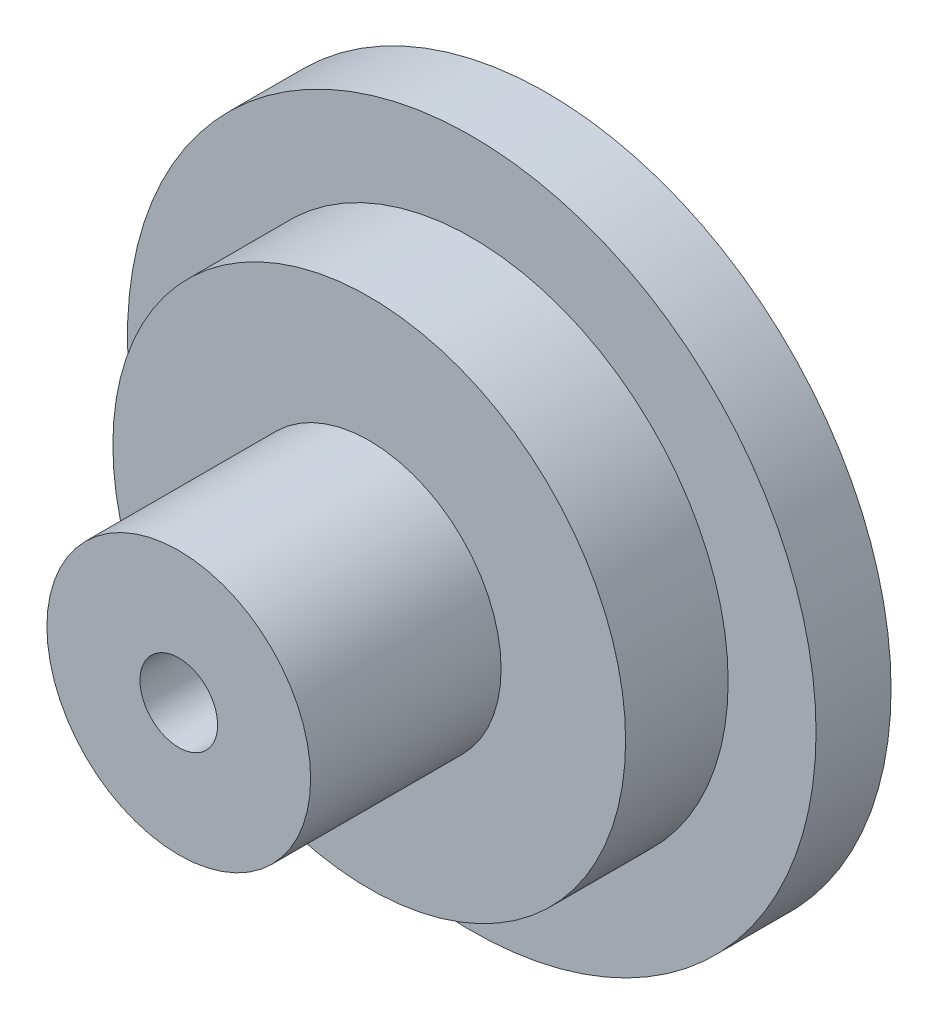
ISO-10303-21;
HEADER;
FILE_DESCRIPTION(('STEP AP214'),'2;1');
FILE_NAME('part.step','',(''),(''),'','','');
FILE_SCHEMA(('AUTOMOTIVE_DESIGN { 1 0 10303 214 1 1 1 1 }'));
ENDSEC;
DATA;
#1=APPLICATION_CONTEXT('core data for automotive mechanical design processes');
#2=APPLICATION_PROTOCOL_DEFINITION('international standard','automotive_design',2000,#1);
#3=PRODUCT_CONTEXT('',#1,'mechanical');
#4=PRODUCT('Part','Part','',(#3));
#5=PRODUCT_RELATED_PRODUCT_CATEGORY('part','',(#4));
#6=PRODUCT_DEFINITION_FORMATION('','',#4);
#7=PRODUCT_DEFINITION_CONTEXT('part definition',#1,'design');
#8=PRODUCT_DEFINITION('design','',#6,#7);
#9=PRODUCT_DEFINITION_SHAPE('','',#8);
#10=(LENGTH_UNIT() NAMED_UNIT(*) SI_UNIT(.MILLI.,.METRE.));
#11=(NAMED_UNIT(*) PLANE_ANGLE_UNIT() SI_UNIT($,.RADIAN.));
#12=(NAMED_UNIT(*) SI_UNIT($,.STERADIAN.) SOLID_ANGLE_UNIT());
#13=UNCERTAINTY_MEASURE_WITH_UNIT(LENGTH_MEASURE(1.E-05),#10,'distance_accuracy_value','');
#14=(GEOMETRIC_REPRESENTATION_CONTEXT(3) GLOBAL_UNCERTAINTY_ASSIGNED_CONTEXT((#13)) GLOBAL_UNIT_ASSIGNED_CONTEXT((#10,
#11,#12)) REPRESENTATION_CONTEXT('',''));
#15=CARTESIAN_POINT('',(0.,0.,0.));
#16=DIRECTION('',(0.,0.,1.));
#17=DIRECTION('',(1.,0.,0.));
#18=AXIS2_PLACEMENT_3D('',#15,#16,#17);
#19=CARTESIAN_POINT('',(0.,0.,5.12));
#20=DIRECTION('',(0.,0.,-1.));
#21=DIRECTION('',(-1.,0.,0.));
#22=AXIS2_PLACEMENT_3D('',#19,#20,#21);
#23=CYLINDRICAL_SURFACE('',#22,23.5);
#24=CARTESIAN_POINT('',(0.,0.,5.12));
#25=DIRECTION('',(0.,0.,1.));
#26=DIRECTION('',(1.,0.,0.));
#27=AXIS2_PLACEMENT_3D('',#24,#25,#26);
#28=CIRCLE('',#27,23.5);
#29=CARTESIAN_POINT('',(23.5,0.,5.12));
#30=VERTEX_POINT('',#29);
#31=EDGE_CURVE('E46',#30,#30,#28,.T.);
#32=ORIENTED_EDGE('',*,*,#31,.F.);
#33=EDGE_LOOP('',(#32));
#34=FACE_BOUND('',#33,.T.);
#35=CARTESIAN_POINT('',(0.,0.,0.));
#36=DIRECTION('',(0.,0.,1.));
#37=DIRECTION('',(1.,0.,0.));
#38=AXIS2_PLACEMENT_3D('',#35,#36,#37);
#39=CIRCLE('',#38,23.5);
#40=CARTESIAN_POINT('',(23.5,0.,0.));
#41=VERTEX_POINT('',#40);
#42=EDGE_CURVE('E37',#41,#41,#39,.T.);
#43=ORIENTED_EDGE('',*,*,#42,.T.);
#44=EDGE_LOOP('',(#43));
#45=FACE_BOUND('',#44,.T.);
#46=ADVANCED_FACE('F34',(#34,#45),#23,.T.);
#47=CARTESIAN_POINT('',(0.,0.,5.12));
#48=DIRECTION('',(0.,0.,1.));
#49=DIRECTION('',(1.,0.,0.));
#50=AXIS2_PLACEMENT_3D('',#47,#48,#49);
#51=PLANE('',#50);
#52=CARTESIAN_POINT('',(0.,0.,5.12));
#53=DIRECTION('',(0.,0.,1.));
#54=DIRECTION('',(1.,0.,0.));
#55=AXIS2_PLACEMENT_3D('',#52,#53,#54);
#56=CIRCLE('',#55,17.5);
#57=CARTESIAN_POINT('',(17.5,0.,5.12));
#58=VERTEX_POINT('',#57);
#59=EDGE_CURVE('E41',#58,#58,#56,.T.);
#60=ORIENTED_EDGE('',*,*,#59,.F.);
#61=EDGE_LOOP('',(#60));
#62=FACE_BOUND('',#61,.T.);
#63=ORIENTED_EDGE('',*,*,#31,.T.);
#64=EDGE_LOOP('',(#63));
#65=FACE_BOUND('',#64,.T.);
#66=ADVANCED_FACE('F64',(#62,#65),#51,.T.);
#67=CARTESIAN_POINT('',(0.,0.,0.));
#68=DIRECTION('',(0.,0.,1.));
#69=DIRECTION('',(1.,0.,0.));
#70=AXIS2_PLACEMENT_3D('',#67,#68,#69);
#71=PLANE('',#70);
#72=CARTESIAN_POINT('',(0.,0.,0.));
#73=DIRECTION('',(0.,0.,-1.));
#74=DIRECTION('',(-1.,0.,0.));
#75=AXIS2_PLACEMENT_3D('',#72,#73,#74);
#76=CIRCLE('',#75,5.6);
#77=CARTESIAN_POINT('',(-5.6,0.,0.));
#78=VERTEX_POINT('',#77);
#79=EDGE_CURVE('E172',#78,#78,#76,.T.);
#80=ORIENTED_EDGE('',*,*,#79,.F.);
#81=EDGE_LOOP('',(#80));
#82=FACE_BOUND('',#81,.T.);
#83=ORIENTED_EDGE('',*,*,#42,.F.);
#84=EDGE_LOOP('',(#83));
#85=FACE_BOUND('',#84,.T.);
#86=ADVANCED_FACE('F61',(#82,#85),#71,.F.);
#87=CARTESIAN_POINT('',(0.,0.,12.12));
#88=DIRECTION('',(0.,0.,-1.));
#89=DIRECTION('',(-1.,0.,0.));
#90=AXIS2_PLACEMENT_3D('',#87,#88,#89);
#91=CYLINDRICAL_SURFACE('',#90,17.5);
#92=CARTESIAN_POINT('',(0.,0.,12.12));
#93=DIRECTION('',(0.,0.,1.));
#94=DIRECTION('',(1.,0.,0.));
#95=AXIS2_PLACEMENT_3D('',#92,#93,#94);
#96=CIRCLE('',#95,17.5);
#97=CARTESIAN_POINT('',(17.5,0.,12.12));
#98=VERTEX_POINT('',#97);
#99=EDGE_CURVE('E52',#98,#98,#96,.T.);
#100=ORIENTED_EDGE('',*,*,#99,.F.);
#101=EDGE_LOOP('',(#100));
#102=FACE_BOUND('',#101,.T.);
#103=ORIENTED_EDGE('',*,*,#59,.T.);
#104=EDGE_LOOP('',(#103));
#105=FACE_BOUND('',#104,.T.);
#106=ADVANCED_FACE('F63',(#102,#105),#91,.T.);
#107=CARTESIAN_POINT('',(0.,0.,12.12));
#108=DIRECTION('',(0.,0.,1.));
#109=DIRECTION('',(1.,0.,0.));
#110=AXIS2_PLACEMENT_3D('',#107,#108,#109);
#111=PLANE('',#110);
#112=CARTESIAN_POINT('',(0.,0.,12.12));
#113=DIRECTION('',(0.,0.,1.));
#114=DIRECTION('',(1.,0.,0.));
#115=AXIS2_PLACEMENT_3D('',#112,#113,#114);
#116=CIRCLE('',#115,9.);
#117=CARTESIAN_POINT('',(9.,0.,12.12));
#118=VERTEX_POINT('',#117);
#119=EDGE_CURVE('E10',#118,#118,#116,.T.);
#120=ORIENTED_EDGE('',*,*,#119,.F.);
#121=EDGE_LOOP('',(#120));
#122=FACE_BOUND('',#121,.T.);
#123=ORIENTED_EDGE('',*,*,#99,.T.);
#124=EDGE_LOOP('',(#123));
#125=FACE_BOUND('',#124,.T.);
#126=ADVANCED_FACE('F71',(#122,#125),#111,.T.);
#127=CARTESIAN_POINT('',(0.,0.,25.12));
#128=DIRECTION('',(0.,0.,-1.));
#129=DIRECTION('',(-1.,0.,0.));
#130=AXIS2_PLACEMENT_3D('',#127,#128,#129);
#131=CYLINDRICAL_SURFACE('',#130,9.);
#132=CARTESIAN_POINT('',(0.,0.,25.12));
#133=DIRECTION('',(0.,0.,1.));
#134=DIRECTION('',(1.,0.,0.));
#135=AXIS2_PLACEMENT_3D('',#132,#133,#134);
#136=CIRCLE('',#135,9.);
#137=CARTESIAN_POINT('',(9.,0.,25.12));
#138=VERTEX_POINT('',#137);
#139=EDGE_CURVE('E50',#138,#138,#136,.T.);
#140=ORIENTED_EDGE('',*,*,#139,.F.);
#141=EDGE_LOOP('',(#140));
#142=FACE_BOUND('',#141,.T.);
#143=ORIENTED_EDGE('',*,*,#119,.T.);
#144=EDGE_LOOP('',(#143));
#145=FACE_BOUND('',#144,.T.);
#146=ADVANCED_FACE('F101',(#142,#145),#131,.T.);
#147=CARTESIAN_POINT('',(0.,0.,25.12));
#148=DIRECTION('',(0.,0.,1.));
#149=DIRECTION('',(1.,0.,0.));
#150=AXIS2_PLACEMENT_3D('',#147,#148,#149);
#151=PLANE('',#150);
#152=CARTESIAN_POINT('',(0.,0.,25.12));
#153=DIRECTION('',(0.,0.,-1.));
#154=DIRECTION('',(-1.,0.,0.));
#155=AXIS2_PLACEMENT_3D('',#152,#153,#154);
#156=CIRCLE('',#155,2.64999999999999);
#157=CARTESIAN_POINT('',(-2.64999999999999,0.,25.12));
#158=VERTEX_POINT('',#157);
#159=EDGE_CURVE('E174',#158,#158,#156,.T.);
#160=ORIENTED_EDGE('',*,*,#159,.T.);
#161=EDGE_LOOP('',(#160));
#162=FACE_BOUND('',#161,.T.);
#163=ORIENTED_EDGE('',*,*,#139,.T.);
#164=EDGE_LOOP('',(#163));
#165=FACE_BOUND('',#164,.T.);
#166=ADVANCED_FACE('F108',(#162,#165),#151,.T.);
#167=CARTESIAN_POINT('',(0.,0.,0.));
#168=DIRECTION('',(0.,0.,-1.));
#169=DIRECTION('',(-1.,0.,0.));
#170=AXIS2_PLACEMENT_3D('',#167,#168,#169);
#171=CYLINDRICAL_SURFACE('',#170,2.65);
#172=ORIENTED_EDGE('',*,*,#159,.F.);
#173=EDGE_LOOP('',(#172));
#174=FACE_BOUND('',#173,.T.);
#175=CARTESIAN_POINT('',(0.,0.,2.95));
#176=DIRECTION('',(0.,0.,-1.));
#177=DIRECTION('',(-1.,0.,0.));
#178=AXIS2_PLACEMENT_3D('',#175,#176,#177);
#179=CIRCLE('',#178,2.65);
#180=CARTESIAN_POINT('',(-2.65,0.,2.95));
#181=VERTEX_POINT('',#180);
#182=EDGE_CURVE('E170',#181,#181,#179,.T.);
#183=ORIENTED_EDGE('',*,*,#182,.T.);
#184=EDGE_LOOP('',(#183));
#185=FACE_BOUND('',#184,.T.);
#186=ADVANCED_FACE('F116',(#174,#185),#171,.F.);
#187=CARTESIAN_POINT('',(0.,0.,0.));
#188=DIRECTION('',(0.,0.,-1.));
#189=DIRECTION('',(-1.,0.,0.));
#190=AXIS2_PLACEMENT_3D('',#187,#188,#189);
#191=CONICAL_SURFACE('',#190,5.6,0.785398163397448);
#192=ORIENTED_EDGE('',*,*,#182,.F.);
#193=EDGE_LOOP('',(#192));
#194=FACE_BOUND('',#193,.T.);
#195=ORIENTED_EDGE('',*,*,#79,.T.);
#196=EDGE_LOOP('',(#195));
#197=FACE_BOUND('',#196,.T.);
#198=ADVANCED_FACE('F127',(#194,#197),#191,.F.);
#199=CLOSED_SHELL('',(#46,#66,#86,#106,#126,#146,#166,#186,#198));
#200=MANIFOLD_SOLID_BREP('B2',#199);
#201=ADVANCED_BREP_SHAPE_REPRESENTATION('',(#18,#200),#14);
#202=SHAPE_DEFINITION_REPRESENTATION(#9,#201);
ENDSEC;
END-ISO-10303-21;
